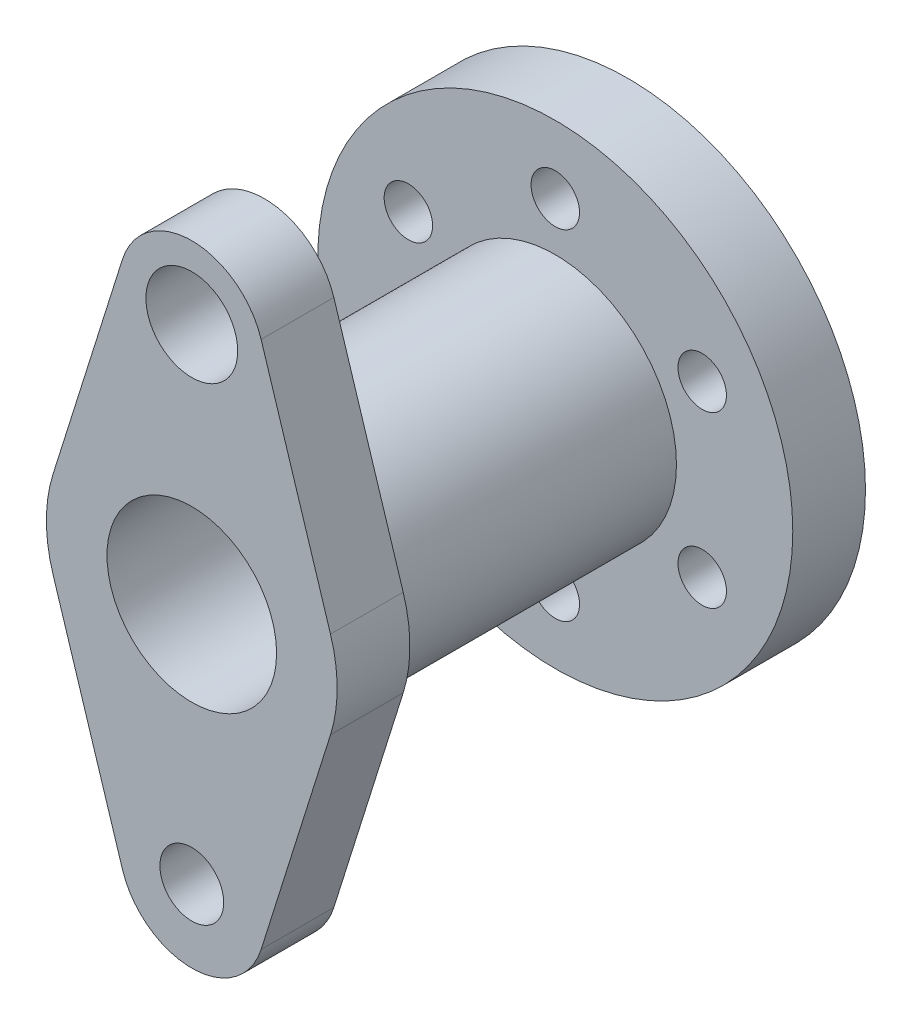
ISO-10303-21;
HEADER;
FILE_DESCRIPTION(('STEP AP214'),'2;1');
FILE_NAME('part.step','',(''),(''),'','','');
FILE_SCHEMA(('AUTOMOTIVE_DESIGN { 1 0 10303 214 1 1 1 1 }'));
ENDSEC;
DATA;
#1=APPLICATION_CONTEXT('core data for automotive mechanical design processes');
#2=APPLICATION_PROTOCOL_DEFINITION('international standard','automotive_design',2000,#1);
#3=PRODUCT_CONTEXT('',#1,'mechanical');
#4=PRODUCT('Part','Part','',(#3));
#5=PRODUCT_RELATED_PRODUCT_CATEGORY('part','',(#4));
#6=PRODUCT_DEFINITION_FORMATION('','',#4);
#7=PRODUCT_DEFINITION_CONTEXT('part definition',#1,'design');
#8=PRODUCT_DEFINITION('design','',#6,#7);
#9=PRODUCT_DEFINITION_SHAPE('','',#8);
#10=(LENGTH_UNIT() NAMED_UNIT(*) SI_UNIT(.MILLI.,.METRE.));
#11=(NAMED_UNIT(*) PLANE_ANGLE_UNIT() SI_UNIT($,.RADIAN.));
#12=(NAMED_UNIT(*) SI_UNIT($,.STERADIAN.) SOLID_ANGLE_UNIT());
#13=UNCERTAINTY_MEASURE_WITH_UNIT(LENGTH_MEASURE(1.E-05),#10,'distance_accuracy_value','');
#14=(GEOMETRIC_REPRESENTATION_CONTEXT(3) GLOBAL_UNCERTAINTY_ASSIGNED_CONTEXT((#13)) GLOBAL_UNIT_ASSIGNED_CONTEXT((#10,
#11,#12)) REPRESENTATION_CONTEXT('',''));
#15=CARTESIAN_POINT('',(0.,0.,0.));
#16=DIRECTION('',(0.,0.,1.));
#17=DIRECTION('',(1.,0.,0.));
#18=AXIS2_PLACEMENT_3D('',#15,#16,#17);
#19=CARTESIAN_POINT('',(0.,0.,45.));
#20=DIRECTION('',(0.,0.,1.));
#21=DIRECTION('',(1.,0.,0.));
#22=AXIS2_PLACEMENT_3D('',#19,#20,#21);
#23=PLANE('',#22);
#24=CARTESIAN_POINT('',(0.,0.,45.));
#25=DIRECTION('',(0.,0.,1.));
#26=DIRECTION('',(1.,0.,0.));
#27=AXIS2_PLACEMENT_3D('',#24,#25,#26);
#28=CIRCLE('',#27,13.);
#29=CARTESIAN_POINT('',(13.,0.,45.));
#30=VERTEX_POINT('',#29);
#31=EDGE_CURVE('E217',#30,#30,#28,.T.);
#32=ORIENTED_EDGE('',*,*,#31,.F.);
#33=EDGE_LOOP('',(#32));
#34=FACE_BOUND('',#33,.T.);
#35=CARTESIAN_POINT('',(0.,0.,45.));
#36=DIRECTION('',(0.,0.,1.));
#37=DIRECTION('',(1.,0.,0.));
#38=AXIS2_PLACEMENT_3D('',#35,#36,#37);
#39=CIRCLE('',#38,17.5);
#40=CARTESIAN_POINT('',(17.5,0.,45.));
#41=VERTEX_POINT('',#40);
#42=EDGE_CURVE('E208',#41,#41,#39,.T.);
#43=ORIENTED_EDGE('',*,*,#42,.T.);
#44=EDGE_LOOP('',(#43));
#45=FACE_BOUND('',#44,.T.);
#46=ADVANCED_FACE('F45',(#34,#45),#23,.T.);
#47=CARTESIAN_POINT('',(0.,0.,15.));
#48=DIRECTION('',(0.,0.,1.));
#49=DIRECTION('',(1.,0.,0.));
#50=AXIS2_PLACEMENT_3D('',#47,#48,#49);
#51=PLANE('',#50);
#52=CARTESIAN_POINT('',(2.44403693719019E-13,-35.,15.));
#53=DIRECTION('',(0.,0.,1.));
#54=DIRECTION('',(1.,0.,0.));
#55=AXIS2_PLACEMENT_3D('',#52,#53,#54);
#56=CIRCLE('',#55,5.);
#57=CARTESIAN_POINT('',(5.00000000000025,-35.,15.));
#58=VERTEX_POINT('',#57);
#59=EDGE_CURVE('E233',#58,#58,#56,.T.);
#60=ORIENTED_EDGE('',*,*,#59,.F.);
#61=EDGE_LOOP('',(#60));
#62=FACE_BOUND('',#61,.T.);
#63=CARTESIAN_POINT('',(30.3108891324552,17.5000000000004,15.));
#64=DIRECTION('',(0.,0.,1.));
#65=DIRECTION('',(1.,0.,0.));
#66=AXIS2_PLACEMENT_3D('',#63,#64,#65);
#67=CIRCLE('',#66,5.);
#68=CARTESIAN_POINT('',(35.3108891324552,17.5000000000004,15.));
#69=VERTEX_POINT('',#68);
#70=EDGE_CURVE('E249',#69,#69,#67,.T.);
#71=ORIENTED_EDGE('',*,*,#70,.F.);
#72=EDGE_LOOP('',(#71));
#73=FACE_BOUND('',#72,.T.);
#74=CARTESIAN_POINT('',(0.,35.,15.));
#75=DIRECTION('',(0.,0.,1.));
#76=DIRECTION('',(1.,0.,0.));
#77=AXIS2_PLACEMENT_3D('',#74,#75,#76);
#78=CIRCLE('',#77,5.);
#79=CARTESIAN_POINT('',(5.,35.,15.));
#80=VERTEX_POINT('',#79);
#81=EDGE_CURVE('E265',#80,#80,#78,.T.);
#82=ORIENTED_EDGE('',*,*,#81,.F.);
#83=EDGE_LOOP('',(#82));
#84=FACE_BOUND('',#83,.T.);
#85=CARTESIAN_POINT('',(0.,0.,15.));
#86=DIRECTION('',(0.,0.,1.));
#87=DIRECTION('',(1.,0.,0.));
#88=AXIS2_PLACEMENT_3D('',#85,#86,#87);
#89=CIRCLE('',#88,49.);
#90=CARTESIAN_POINT('',(49.,0.,15.));
#91=VERTEX_POINT('',#90);
#92=EDGE_CURVE('E11',#91,#91,#89,.T.);
#93=ORIENTED_EDGE('',*,*,#92,.T.);
#94=EDGE_LOOP('',(#93));
#95=FACE_BOUND('',#94,.T.);
#96=CARTESIAN_POINT('',(0.,0.,15.));
#97=DIRECTION('',(0.,0.,1.));
#98=DIRECTION('',(1.,0.,0.));
#99=AXIS2_PLACEMENT_3D('',#96,#97,#98);
#100=CIRCLE('',#99,25.);
#101=CARTESIAN_POINT('',(25.,0.,15.));
#102=VERTEX_POINT('',#101);
#103=EDGE_CURVE('E269',#102,#102,#100,.T.);
#104=ORIENTED_EDGE('',*,*,#103,.F.);
#105=EDGE_LOOP('',(#104));
#106=FACE_BOUND('',#105,.T.);
#107=CARTESIAN_POINT('',(-30.3108891324554,17.4999999999999,15.));
#108=DIRECTION('',(0.,0.,1.));
#109=DIRECTION('',(1.,0.,0.));
#110=AXIS2_PLACEMENT_3D('',#107,#108,#109);
#111=CIRCLE('',#110,5.);
#112=CARTESIAN_POINT('',(-25.3108891324554,17.4999999999999,15.));
#113=VERTEX_POINT('',#112);
#114=EDGE_CURVE('E257',#113,#113,#111,.T.);
#115=ORIENTED_EDGE('',*,*,#114,.F.);
#116=EDGE_LOOP('',(#115));
#117=FACE_BOUND('',#116,.T.);
#118=CARTESIAN_POINT('',(30.3108891324555,-17.4999999999997,15.));
#119=DIRECTION('',(0.,0.,1.));
#120=DIRECTION('',(1.,0.,0.));
#121=AXIS2_PLACEMENT_3D('',#118,#119,#120);
#122=CIRCLE('',#121,5.);
#123=CARTESIAN_POINT('',(35.3108891324555,-17.4999999999997,15.));
#124=VERTEX_POINT('',#123);
#125=EDGE_CURVE('E241',#124,#124,#122,.T.);
#126=ORIENTED_EDGE('',*,*,#125,.F.);
#127=EDGE_LOOP('',(#126));
#128=FACE_BOUND('',#127,.T.);
#129=CARTESIAN_POINT('',(-30.3108891324553,-17.5000000000001,15.));
#130=DIRECTION('',(0.,0.,1.));
#131=DIRECTION('',(1.,0.,0.));
#132=AXIS2_PLACEMENT_3D('',#129,#130,#131);
#133=CIRCLE('',#132,5.);
#134=CARTESIAN_POINT('',(-25.3108891324553,-17.5000000000001,15.));
#135=VERTEX_POINT('',#134);
#136=EDGE_CURVE('E225',#135,#135,#133,.T.);
#137=ORIENTED_EDGE('',*,*,#136,.F.);
#138=EDGE_LOOP('',(#137));
#139=FACE_BOUND('',#138,.T.);
#140=ADVANCED_FACE('F285',(#62,#73,#84,#95,#106,#117,#128,#139),#51,.T.);
#141=CARTESIAN_POINT('',(0.,0.,0.));
#142=DIRECTION('',(0.,0.,1.));
#143=DIRECTION('',(1.,0.,0.));
#144=AXIS2_PLACEMENT_3D('',#141,#142,#143);
#145=PLANE('',#144);
#146=CARTESIAN_POINT('',(0.,0.,0.));
#147=DIRECTION('',(0.,0.,1.));
#148=DIRECTION('',(1.,0.,0.));
#149=AXIS2_PLACEMENT_3D('',#146,#147,#148);
#150=CIRCLE('',#149,49.);
#151=CARTESIAN_POINT('',(49.,0.,0.));
#152=VERTEX_POINT('',#151);
#153=EDGE_CURVE('E49',#152,#152,#150,.T.);
#154=ORIENTED_EDGE('',*,*,#153,.F.);
#155=EDGE_LOOP('',(#154));
#156=FACE_BOUND('',#155,.T.);
#157=CARTESIAN_POINT('',(0.,35.,0.));
#158=DIRECTION('',(0.,0.,1.));
#159=DIRECTION('',(1.,0.,0.));
#160=AXIS2_PLACEMENT_3D('',#157,#158,#159);
#161=CIRCLE('',#160,5.);
#162=CARTESIAN_POINT('',(5.,35.,0.));
#163=VERTEX_POINT('',#162);
#164=EDGE_CURVE('E261',#163,#163,#161,.T.);
#165=ORIENTED_EDGE('',*,*,#164,.T.);
#166=EDGE_LOOP('',(#165));
#167=FACE_BOUND('',#166,.T.);
#168=CARTESIAN_POINT('',(-30.3108891324554,17.4999999999999,0.));
#169=DIRECTION('',(0.,0.,1.));
#170=DIRECTION('',(1.,0.,0.));
#171=AXIS2_PLACEMENT_3D('',#168,#169,#170);
#172=CIRCLE('',#171,5.);
#173=CARTESIAN_POINT('',(-25.3108891324554,17.4999999999999,0.));
#174=VERTEX_POINT('',#173);
#175=EDGE_CURVE('E253',#174,#174,#172,.T.);
#176=ORIENTED_EDGE('',*,*,#175,.T.);
#177=EDGE_LOOP('',(#176));
#178=FACE_BOUND('',#177,.T.);
#179=CARTESIAN_POINT('',(30.3108891324552,17.5000000000004,0.));
#180=DIRECTION('',(0.,0.,1.));
#181=DIRECTION('',(1.,0.,0.));
#182=AXIS2_PLACEMENT_3D('',#179,#180,#181);
#183=CIRCLE('',#182,5.);
#184=CARTESIAN_POINT('',(35.3108891324552,17.5000000000004,0.));
#185=VERTEX_POINT('',#184);
#186=EDGE_CURVE('E245',#185,#185,#183,.T.);
#187=ORIENTED_EDGE('',*,*,#186,.T.);
#188=EDGE_LOOP('',(#187));
#189=FACE_BOUND('',#188,.T.);
#190=CARTESIAN_POINT('',(30.3108891324555,-17.4999999999997,0.));
#191=DIRECTION('',(0.,0.,1.));
#192=DIRECTION('',(1.,0.,0.));
#193=AXIS2_PLACEMENT_3D('',#190,#191,#192);
#194=CIRCLE('',#193,5.);
#195=CARTESIAN_POINT('',(35.3108891324555,-17.4999999999997,0.));
#196=VERTEX_POINT('',#195);
#197=EDGE_CURVE('E237',#196,#196,#194,.T.);
#198=ORIENTED_EDGE('',*,*,#197,.T.);
#199=EDGE_LOOP('',(#198));
#200=FACE_BOUND('',#199,.T.);
#201=CARTESIAN_POINT('',(2.44403693719019E-13,-35.,0.));
#202=DIRECTION('',(0.,0.,1.));
#203=DIRECTION('',(1.,0.,0.));
#204=AXIS2_PLACEMENT_3D('',#201,#202,#203);
#205=CIRCLE('',#204,5.);
#206=CARTESIAN_POINT('',(5.00000000000025,-35.,0.));
#207=VERTEX_POINT('',#206);
#208=EDGE_CURVE('E229',#207,#207,#205,.T.);
#209=ORIENTED_EDGE('',*,*,#208,.T.);
#210=EDGE_LOOP('',(#209));
#211=FACE_BOUND('',#210,.T.);
#212=CARTESIAN_POINT('',(-30.3108891324553,-17.5000000000001,0.));
#213=DIRECTION('',(0.,0.,1.));
#214=DIRECTION('',(1.,0.,0.));
#215=AXIS2_PLACEMENT_3D('',#212,#213,#214);
#216=CIRCLE('',#215,5.);
#217=CARTESIAN_POINT('',(-25.3108891324553,-17.5000000000001,0.));
#218=VERTEX_POINT('',#217);
#219=EDGE_CURVE('E221',#218,#218,#216,.T.);
#220=ORIENTED_EDGE('',*,*,#219,.T.);
#221=EDGE_LOOP('',(#220));
#222=FACE_BOUND('',#221,.T.);
#223=CARTESIAN_POINT('',(0.,0.,0.));
#224=DIRECTION('',(0.,0.,1.));
#225=DIRECTION('',(1.,0.,0.));
#226=AXIS2_PLACEMENT_3D('',#223,#224,#225);
#227=CIRCLE('',#226,13.);
#228=CARTESIAN_POINT('',(13.,0.,0.));
#229=VERTEX_POINT('',#228);
#230=EDGE_CURVE('E216',#229,#229,#227,.T.);
#231=ORIENTED_EDGE('',*,*,#230,.T.);
#232=EDGE_LOOP('',(#231));
#233=FACE_BOUND('',#232,.T.);
#234=ADVANCED_FACE('F282',(#156,#167,#178,#189,#200,#211,#222,#233),#145,.F.);
#235=CARTESIAN_POINT('',(0.,0.,15.));
#236=DIRECTION('',(0.,0.,-1.));
#237=DIRECTION('',(-1.,0.,0.));
#238=AXIS2_PLACEMENT_3D('',#235,#236,#237);
#239=CYLINDRICAL_SURFACE('',#238,49.);
#240=ORIENTED_EDGE('',*,*,#92,.F.);
#241=EDGE_LOOP('',(#240));
#242=FACE_BOUND('',#241,.T.);
#243=ORIENTED_EDGE('',*,*,#153,.T.);
#244=EDGE_LOOP('',(#243));
#245=FACE_BOUND('',#244,.T.);
#246=ADVANCED_FACE('F47',(#242,#245),#239,.T.);
#247=CARTESIAN_POINT('',(0.,35.,15.));
#248=DIRECTION('',(0.,0.,-1.));
#249=DIRECTION('',(-1.,0.,0.));
#250=AXIS2_PLACEMENT_3D('',#247,#248,#249);
#251=CYLINDRICAL_SURFACE('',#250,5.);
#252=ORIENTED_EDGE('',*,*,#81,.T.);
#253=EDGE_LOOP('',(#252));
#254=FACE_BOUND('',#253,.T.);
#255=ORIENTED_EDGE('',*,*,#164,.F.);
#256=EDGE_LOOP('',(#255));
#257=FACE_BOUND('',#256,.T.);
#258=ADVANCED_FACE('F344',(#254,#257),#251,.F.);
#259=CARTESIAN_POINT('',(-30.3108891324554,17.4999999999999,15.));
#260=DIRECTION('',(0.,0.,-1.));
#261=DIRECTION('',(-1.,0.,0.));
#262=AXIS2_PLACEMENT_3D('',#259,#260,#261);
#263=CYLINDRICAL_SURFACE('',#262,5.);
#264=ORIENTED_EDGE('',*,*,#114,.T.);
#265=EDGE_LOOP('',(#264));
#266=FACE_BOUND('',#265,.T.);
#267=ORIENTED_EDGE('',*,*,#175,.F.);
#268=EDGE_LOOP('',(#267));
#269=FACE_BOUND('',#268,.T.);
#270=ADVANCED_FACE('F340',(#266,#269),#263,.F.);
#271=CARTESIAN_POINT('',(30.3108891324552,17.5000000000004,15.));
#272=DIRECTION('',(0.,0.,-1.));
#273=DIRECTION('',(-1.,0.,0.));
#274=AXIS2_PLACEMENT_3D('',#271,#272,#273);
#275=CYLINDRICAL_SURFACE('',#274,5.);
#276=ORIENTED_EDGE('',*,*,#70,.T.);
#277=EDGE_LOOP('',(#276));
#278=FACE_BOUND('',#277,.T.);
#279=ORIENTED_EDGE('',*,*,#186,.F.);
#280=EDGE_LOOP('',(#279));
#281=FACE_BOUND('',#280,.T.);
#282=ADVANCED_FACE('F336',(#278,#281),#275,.F.);
#283=CARTESIAN_POINT('',(30.3108891324555,-17.4999999999997,15.));
#284=DIRECTION('',(0.,0.,-1.));
#285=DIRECTION('',(-1.,0.,0.));
#286=AXIS2_PLACEMENT_3D('',#283,#284,#285);
#287=CYLINDRICAL_SURFACE('',#286,5.);
#288=ORIENTED_EDGE('',*,*,#125,.T.);
#289=EDGE_LOOP('',(#288));
#290=FACE_BOUND('',#289,.T.);
#291=ORIENTED_EDGE('',*,*,#197,.F.);
#292=EDGE_LOOP('',(#291));
#293=FACE_BOUND('',#292,.T.);
#294=ADVANCED_FACE('F332',(#290,#293),#287,.F.);
#295=CARTESIAN_POINT('',(2.44403693719019E-13,-35.,15.));
#296=DIRECTION('',(0.,0.,-1.));
#297=DIRECTION('',(-1.,0.,0.));
#298=AXIS2_PLACEMENT_3D('',#295,#296,#297);
#299=CYLINDRICAL_SURFACE('',#298,5.);
#300=ORIENTED_EDGE('',*,*,#59,.T.);
#301=EDGE_LOOP('',(#300));
#302=FACE_BOUND('',#301,.T.);
#303=ORIENTED_EDGE('',*,*,#208,.F.);
#304=EDGE_LOOP('',(#303));
#305=FACE_BOUND('',#304,.T.);
#306=ADVANCED_FACE('F328',(#302,#305),#299,.F.);
#307=CARTESIAN_POINT('',(-30.3108891324553,-17.5000000000001,15.));
#308=DIRECTION('',(0.,0.,-1.));
#309=DIRECTION('',(-1.,0.,0.));
#310=AXIS2_PLACEMENT_3D('',#307,#308,#309);
#311=CYLINDRICAL_SURFACE('',#310,5.);
#312=ORIENTED_EDGE('',*,*,#136,.T.);
#313=EDGE_LOOP('',(#312));
#314=FACE_BOUND('',#313,.T.);
#315=ORIENTED_EDGE('',*,*,#219,.F.);
#316=EDGE_LOOP('',(#315));
#317=FACE_BOUND('',#316,.T.);
#318=ADVANCED_FACE('F313',(#314,#317),#311,.F.);
#319=CARTESIAN_POINT('',(0.,0.,45.));
#320=DIRECTION('',(0.,0.,-1.));
#321=DIRECTION('',(-1.,0.,0.));
#322=AXIS2_PLACEMENT_3D('',#319,#320,#321);
#323=CYLINDRICAL_SURFACE('',#322,25.);
#324=ORIENTED_EDGE('',*,*,#103,.T.);
#325=EDGE_LOOP('',(#324));
#326=FACE_BOUND('',#325,.T.);
#327=CARTESIAN_POINT('',(0.,0.,75.));
#328=DIRECTION('',(0.,0.,1.));
#329=DIRECTION('',(1.,0.,0.));
#330=AXIS2_PLACEMENT_3D('',#327,#328,#329);
#331=CIRCLE('',#330,25.);
#332=CARTESIAN_POINT('',(25.,0.,75.));
#333=VERTEX_POINT('',#332);
#334=EDGE_CURVE('E212',#333,#333,#331,.T.);
#335=ORIENTED_EDGE('',*,*,#334,.F.);
#336=EDGE_LOOP('',(#335));
#337=FACE_BOUND('',#336,.T.);
#338=ADVANCED_FACE('F303',(#326,#337),#323,.T.);
#339=CARTESIAN_POINT('',(0.,0.,45.));
#340=DIRECTION('',(0.,0.,-1.));
#341=DIRECTION('',(-1.,0.,0.));
#342=AXIS2_PLACEMENT_3D('',#339,#340,#341);
#343=CYLINDRICAL_SURFACE('',#342,13.);
#344=ORIENTED_EDGE('',*,*,#31,.T.);
#345=EDGE_LOOP('',(#344));
#346=FACE_BOUND('',#345,.T.);
#347=ORIENTED_EDGE('',*,*,#230,.F.);
#348=EDGE_LOOP('',(#347));
#349=FACE_BOUND('',#348,.T.);
#350=ADVANCED_FACE('F300',(#346,#349),#343,.F.);
#351=CARTESIAN_POINT('',(0.,0.,75.));
#352=DIRECTION('',(0.,0.,-1.));
#353=DIRECTION('',(-1.,0.,0.));
#354=AXIS2_PLACEMENT_3D('',#351,#352,#353);
#355=CYLINDRICAL_SURFACE('',#354,17.5);
#356=ORIENTED_EDGE('',*,*,#42,.F.);
#357=EDGE_LOOP('',(#356));
#358=FACE_BOUND('',#357,.T.);
#359=CARTESIAN_POINT('',(0.,0.,90.));
#360=DIRECTION('',(0.,0.,1.));
#361=DIRECTION('',(1.,0.,0.));
#362=AXIS2_PLACEMENT_3D('',#359,#360,#361);
#363=CIRCLE('',#362,17.5);
#364=CARTESIAN_POINT('',(17.5,0.,90.));
#365=VERTEX_POINT('',#364);
#366=EDGE_CURVE('E161',#365,#365,#363,.T.);
#367=ORIENTED_EDGE('',*,*,#366,.T.);
#368=EDGE_LOOP('',(#367));
#369=FACE_BOUND('',#368,.T.);
#370=ADVANCED_FACE('F302',(#358,#369),#355,.F.);
#371=CARTESIAN_POINT('',(28.6181760425084,-8.99999999999998,90.));
#372=DIRECTION('',(0.953939201416946,-0.299999999999999,0.));
#373=DIRECTION('',(0.299999999999999,0.953939201416946,0.));
#374=AXIS2_PLACEMENT_3D('',#371,#372,#373);
#375=PLANE('',#374);
#376=DIRECTION('',(-0.299999999999999,-0.953939201416946,0.));
#377=VECTOR('',#376,1.);
#378=CARTESIAN_POINT('',(28.6181760425084,-8.99999999999998,75.));
#379=LINE('',#378,#377);
#380=CARTESIAN_POINT('',(28.6181760425084,-8.99999999999998,75.));
#381=VERTEX_POINT('',#380);
#382=CARTESIAN_POINT('',(14.3090880212542,-54.5,75.));
#383=VERTEX_POINT('',#382);
#384=EDGE_CURVE('E156',#381,#383,#379,.T.);
#385=ORIENTED_EDGE('',*,*,#384,.F.);
#386=DIRECTION('',(0.,0.,-1.));
#387=VECTOR('',#386,1.);
#388=CARTESIAN_POINT('',(28.6181760425084,-8.99999999999998,90.));
#389=LINE('',#388,#387);
#390=CARTESIAN_POINT('',(28.6181760425084,-8.99999999999998,90.));
#391=VERTEX_POINT('',#390);
#392=EDGE_CURVE('E104',#391,#381,#389,.T.);
#393=ORIENTED_EDGE('',*,*,#392,.F.);
#394=DIRECTION('',(-0.299999999999999,-0.953939201416946,0.));
#395=VECTOR('',#394,1.);
#396=CARTESIAN_POINT('',(28.6181760425084,-8.99999999999998,90.));
#397=LINE('',#396,#395);
#398=CARTESIAN_POINT('',(14.3090880212542,-54.5,90.));
#399=VERTEX_POINT('',#398);
#400=EDGE_CURVE('E188',#391,#399,#397,.T.);
#401=ORIENTED_EDGE('',*,*,#400,.T.);
#402=DIRECTION('',(0.,0.,-1.));
#403=VECTOR('',#402,1.);
#404=CARTESIAN_POINT('',(14.3090880212542,-54.5,90.));
#405=LINE('',#404,#403);
#406=EDGE_CURVE('E99',#399,#383,#405,.T.);
#407=ORIENTED_EDGE('',*,*,#406,.T.);
#408=EDGE_LOOP('',(#385,#393,#401,#407));
#409=FACE_BOUND('',#408,.T.);
#410=ADVANCED_FACE('F310',(#409),#375,.T.);
#411=CARTESIAN_POINT('',(0.,0.,90.));
#412=DIRECTION('',(0.,0.,-1.));
#413=DIRECTION('',(-1.,0.,0.));
#414=AXIS2_PLACEMENT_3D('',#411,#412,#413);
#415=CYLINDRICAL_SURFACE('',#414,30.);
#416=CARTESIAN_POINT('',(0.,0.,75.));
#417=DIRECTION('',(0.,0.,1.));
#418=DIRECTION('',(1.,0.,0.));
#419=AXIS2_PLACEMENT_3D('',#416,#417,#418);
#420=CIRCLE('',#419,30.);
#421=CARTESIAN_POINT('',(28.6181760425084,8.99999999999998,75.));
#422=VERTEX_POINT('',#421);
#423=EDGE_CURVE('E160',#381,#422,#420,.T.);
#424=ORIENTED_EDGE('',*,*,#423,.T.);
#425=DIRECTION('',(0.,0.,-1.));
#426=VECTOR('',#425,1.);
#427=CARTESIAN_POINT('',(28.6181760425084,8.99999999999998,90.));
#428=LINE('',#427,#426);
#429=CARTESIAN_POINT('',(28.6181760425084,8.99999999999998,90.));
#430=VERTEX_POINT('',#429);
#431=EDGE_CURVE('E202',#430,#422,#428,.T.);
#432=ORIENTED_EDGE('',*,*,#431,.F.);
#433=CARTESIAN_POINT('',(0.,0.,90.));
#434=DIRECTION('',(0.,0.,1.));
#435=DIRECTION('',(1.,0.,0.));
#436=AXIS2_PLACEMENT_3D('',#433,#434,#435);
#437=CIRCLE('',#436,30.);
#438=EDGE_CURVE('E131',#391,#430,#437,.T.);
#439=ORIENTED_EDGE('',*,*,#438,.F.);
#440=ORIENTED_EDGE('',*,*,#392,.T.);
#441=EDGE_LOOP('',(#424,#432,#439,#440));
#442=FACE_BOUND('',#441,.T.);
#443=ADVANCED_FACE('F454',(#442),#415,.T.);
#444=CARTESIAN_POINT('',(28.6181760425084,8.99999999999998,90.));
#445=DIRECTION('',(-0.953939201416946,-0.299999999999999,0.));
#446=DIRECTION('',(0.299999999999999,-0.953939201416946,0.));
#447=AXIS2_PLACEMENT_3D('',#444,#445,#446);
#448=PLANE('',#447);
#449=DIRECTION('',(-0.299999999999999,0.953939201416946,0.));
#450=VECTOR('',#449,1.);
#451=CARTESIAN_POINT('',(28.6181760425084,8.99999999999998,75.));
#452=LINE('',#451,#450);
#453=CARTESIAN_POINT('',(14.3090880212542,54.5,75.));
#454=VERTEX_POINT('',#453);
#455=EDGE_CURVE('E164',#422,#454,#452,.T.);
#456=ORIENTED_EDGE('',*,*,#455,.T.);
#457=DIRECTION('',(0.,0.,-1.));
#458=VECTOR('',#457,1.);
#459=CARTESIAN_POINT('',(14.3090880212542,54.5,90.));
#460=LINE('',#459,#458);
#461=CARTESIAN_POINT('',(14.3090880212542,54.5,90.));
#462=VERTEX_POINT('',#461);
#463=EDGE_CURVE('E198',#462,#454,#460,.T.);
#464=ORIENTED_EDGE('',*,*,#463,.F.);
#465=DIRECTION('',(-0.299999999999999,0.953939201416946,0.));
#466=VECTOR('',#465,1.);
#467=CARTESIAN_POINT('',(28.6181760425084,8.99999999999998,90.));
#468=LINE('',#467,#466);
#469=EDGE_CURVE('E628',#430,#462,#468,.T.);
#470=ORIENTED_EDGE('',*,*,#469,.F.);
#471=ORIENTED_EDGE('',*,*,#431,.T.);
#472=EDGE_LOOP('',(#456,#464,#470,#471));
#473=FACE_BOUND('',#472,.T.);
#474=ADVANCED_FACE('F464',(#473),#448,.F.);
#475=CARTESIAN_POINT('',(0.,50.,90.));
#476=DIRECTION('',(0.,0.,-1.));
#477=DIRECTION('',(-1.,0.,0.));
#478=AXIS2_PLACEMENT_3D('',#475,#476,#477);
#479=CYLINDRICAL_SURFACE('',#478,15.);
#480=CARTESIAN_POINT('',(0.,50.,75.));
#481=DIRECTION('',(0.,0.,1.));
#482=DIRECTION('',(1.,0.,0.));
#483=AXIS2_PLACEMENT_3D('',#480,#481,#482);
#484=CIRCLE('',#483,15.);
#485=CARTESIAN_POINT('',(-14.3090880212542,54.4999999999999,75.));
#486=VERTEX_POINT('',#485);
#487=EDGE_CURVE('E167',#454,#486,#484,.T.);
#488=ORIENTED_EDGE('',*,*,#487,.T.);
#489=DIRECTION('',(0.,0.,-1.));
#490=VECTOR('',#489,1.);
#491=CARTESIAN_POINT('',(-14.3090880212542,54.4999999999999,90.));
#492=LINE('',#491,#490);
#493=CARTESIAN_POINT('',(-14.3090880212542,54.4999999999999,90.));
#494=VERTEX_POINT('',#493);
#495=EDGE_CURVE('E195',#494,#486,#492,.T.);
#496=ORIENTED_EDGE('',*,*,#495,.F.);
#497=CARTESIAN_POINT('',(0.,50.,90.));
#498=DIRECTION('',(0.,0.,1.));
#499=DIRECTION('',(1.,0.,0.));
#500=AXIS2_PLACEMENT_3D('',#497,#498,#499);
#501=CIRCLE('',#500,15.);
#502=EDGE_CURVE('E630',#462,#494,#501,.T.);
#503=ORIENTED_EDGE('',*,*,#502,.F.);
#504=ORIENTED_EDGE('',*,*,#463,.T.);
#505=EDGE_LOOP('',(#488,#496,#503,#504));
#506=FACE_BOUND('',#505,.T.);
#507=ADVANCED_FACE('F475',(#506),#479,.T.);
#508=CARTESIAN_POINT('',(-28.6181760425084,9.,90.));
#509=DIRECTION('',(-0.953939201416946,0.3,0.));
#510=DIRECTION('',(-0.3,-0.953939201416946,0.));
#511=AXIS2_PLACEMENT_3D('',#508,#509,#510);
#512=PLANE('',#511);
#513=DIRECTION('',(0.3,0.953939201416946,0.));
#514=VECTOR('',#513,1.);
#515=CARTESIAN_POINT('',(-28.6181760425084,9.,75.));
#516=LINE('',#515,#514);
#517=CARTESIAN_POINT('',(-28.6181760425084,9.00000000000001,75.));
#518=VERTEX_POINT('',#517);
#519=EDGE_CURVE('E171',#518,#486,#516,.T.);
#520=ORIENTED_EDGE('',*,*,#519,.F.);
#521=DIRECTION('',(0.,0.,-1.));
#522=VECTOR('',#521,1.);
#523=CARTESIAN_POINT('',(-28.6181760425084,9.00000000000001,90.));
#524=LINE('',#523,#522);
#525=CARTESIAN_POINT('',(-28.6181760425084,9.00000000000001,90.));
#526=VERTEX_POINT('',#525);
#527=EDGE_CURVE('E137',#526,#518,#524,.T.);
#528=ORIENTED_EDGE('',*,*,#527,.F.);
#529=DIRECTION('',(0.3,0.953939201416946,0.));
#530=VECTOR('',#529,1.);
#531=CARTESIAN_POINT('',(-28.6181760425084,9.,90.));
#532=LINE('',#531,#530);
#533=EDGE_CURVE('E127',#526,#494,#532,.T.);
#534=ORIENTED_EDGE('',*,*,#533,.T.);
#535=ORIENTED_EDGE('',*,*,#495,.T.);
#536=EDGE_LOOP('',(#520,#528,#534,#535));
#537=FACE_BOUND('',#536,.T.);
#538=ADVANCED_FACE('F486',(#537),#512,.T.);
#539=CARTESIAN_POINT('',(-28.6181760425084,-9.00000000000001,75.));
#540=VERTEX_POINT('',#539);
#541=EDGE_CURVE('E135',#518,#540,#420,.T.);
#542=ORIENTED_EDGE('',*,*,#541,.T.);
#543=DIRECTION('',(0.,0.,-1.));
#544=VECTOR('',#543,1.);
#545=CARTESIAN_POINT('',(-28.6181760425084,-9.00000000000001,90.));
#546=LINE('',#545,#544);
#547=CARTESIAN_POINT('',(-28.6181760425084,-9.00000000000001,90.));
#548=VERTEX_POINT('',#547);
#549=EDGE_CURVE('E132',#548,#540,#546,.T.);
#550=ORIENTED_EDGE('',*,*,#549,.F.);
#551=EDGE_CURVE('E120',#526,#548,#437,.T.);
#552=ORIENTED_EDGE('',*,*,#551,.F.);
#553=ORIENTED_EDGE('',*,*,#527,.T.);
#554=EDGE_LOOP('',(#542,#550,#552,#553));
#555=FACE_BOUND('',#554,.T.);
#556=ADVANCED_FACE('F133',(#555),#415,.T.);
#557=CARTESIAN_POINT('',(-28.6181760425084,-9.,90.));
#558=DIRECTION('',(0.953939201416946,0.3,0.));
#559=DIRECTION('',(-0.3,0.953939201416946,0.));
#560=AXIS2_PLACEMENT_3D('',#557,#558,#559);
#561=PLANE('',#560);
#562=DIRECTION('',(0.3,-0.953939201416946,0.));
#563=VECTOR('',#562,1.);
#564=CARTESIAN_POINT('',(-28.6181760425084,-9.,75.));
#565=LINE('',#564,#563);
#566=CARTESIAN_POINT('',(-14.3090880212542,-54.4999999999999,75.));
#567=VERTEX_POINT('',#566);
#568=EDGE_CURVE('E92',#540,#567,#565,.T.);
#569=ORIENTED_EDGE('',*,*,#568,.T.);
#570=DIRECTION('',(0.,0.,-1.));
#571=VECTOR('',#570,1.);
#572=CARTESIAN_POINT('',(-14.3090880212542,-54.4999999999999,90.));
#573=LINE('',#572,#571);
#574=CARTESIAN_POINT('',(-14.3090880212542,-54.4999999999999,90.));
#575=VERTEX_POINT('',#574);
#576=EDGE_CURVE('E138',#575,#567,#573,.T.);
#577=ORIENTED_EDGE('',*,*,#576,.F.);
#578=DIRECTION('',(0.3,-0.953939201416946,0.));
#579=VECTOR('',#578,1.);
#580=CARTESIAN_POINT('',(-28.6181760425084,-9.,90.));
#581=LINE('',#580,#579);
#582=EDGE_CURVE('E125',#548,#575,#581,.T.);
#583=ORIENTED_EDGE('',*,*,#582,.F.);
#584=ORIENTED_EDGE('',*,*,#549,.T.);
#585=EDGE_LOOP('',(#569,#577,#583,#584));
#586=FACE_BOUND('',#585,.T.);
#587=ADVANCED_FACE('F140',(#586),#561,.F.);
#588=CARTESIAN_POINT('',(0.,-50.,90.));
#589=DIRECTION('',(0.,0.,-1.));
#590=DIRECTION('',(-1.,0.,0.));
#591=AXIS2_PLACEMENT_3D('',#588,#589,#590);
#592=CYLINDRICAL_SURFACE('',#591,6.5829747291931);
#593=CARTESIAN_POINT('',(0.,-50.,90.));
#594=DIRECTION('',(0.,0.,1.));
#595=DIRECTION('',(1.,0.,0.));
#596=AXIS2_PLACEMENT_3D('',#593,#594,#595);
#597=CIRCLE('',#596,6.5829747291931);
#598=CARTESIAN_POINT('',(6.58297472919311,-50.,90.));
#599=VERTEX_POINT('',#598);
#600=EDGE_CURVE('E144',#599,#599,#597,.T.);
#601=ORIENTED_EDGE('',*,*,#600,.T.);
#602=EDGE_LOOP('',(#601));
#603=FACE_BOUND('',#602,.T.);
#604=CARTESIAN_POINT('',(0.,-50.,75.));
#605=DIRECTION('',(0.,0.,1.));
#606=DIRECTION('',(1.,0.,0.));
#607=AXIS2_PLACEMENT_3D('',#604,#605,#606);
#608=CIRCLE('',#607,6.5829747291931);
#609=CARTESIAN_POINT('',(6.58297472919311,-50.,75.));
#610=VERTEX_POINT('',#609);
#611=EDGE_CURVE('E180',#610,#610,#608,.T.);
#612=ORIENTED_EDGE('',*,*,#611,.F.);
#613=EDGE_LOOP('',(#612));
#614=FACE_BOUND('',#613,.T.);
#615=ADVANCED_FACE('F515',(#603,#614),#592,.F.);
#616=CARTESIAN_POINT('',(0.,-50.,90.));
#617=DIRECTION('',(0.,0.,-1.));
#618=DIRECTION('',(-1.,0.,0.));
#619=AXIS2_PLACEMENT_3D('',#616,#617,#618);
#620=CYLINDRICAL_SURFACE('',#619,15.);
#621=CARTESIAN_POINT('',(0.,-50.,75.));
#622=DIRECTION('',(0.,0.,1.));
#623=DIRECTION('',(1.,0.,0.));
#624=AXIS2_PLACEMENT_3D('',#621,#622,#623);
#625=CIRCLE('',#624,15.);
#626=EDGE_CURVE('E177',#567,#383,#625,.T.);
#627=ORIENTED_EDGE('',*,*,#626,.T.);
#628=ORIENTED_EDGE('',*,*,#406,.F.);
#629=CARTESIAN_POINT('',(0.,-50.,90.));
#630=DIRECTION('',(0.,0.,1.));
#631=DIRECTION('',(1.,0.,0.));
#632=AXIS2_PLACEMENT_3D('',#629,#630,#631);
#633=CIRCLE('',#632,15.);
#634=EDGE_CURVE('E63',#575,#399,#633,.T.);
#635=ORIENTED_EDGE('',*,*,#634,.F.);
#636=ORIENTED_EDGE('',*,*,#576,.T.);
#637=EDGE_LOOP('',(#627,#628,#635,#636));
#638=FACE_BOUND('',#637,.T.);
#639=ADVANCED_FACE('F525',(#638),#620,.T.);
#640=CARTESIAN_POINT('',(0.,50.,90.));
#641=DIRECTION('',(0.,0.,-1.));
#642=DIRECTION('',(-1.,0.,0.));
#643=AXIS2_PLACEMENT_3D('',#640,#641,#642);
#644=CYLINDRICAL_SURFACE('',#643,9.46577149601455);
#645=CARTESIAN_POINT('',(0.,50.,90.));
#646=DIRECTION('',(0.,0.,1.));
#647=DIRECTION('',(1.,0.,0.));
#648=AXIS2_PLACEMENT_3D('',#645,#646,#647);
#649=CIRCLE('',#648,9.46577149601455);
#650=CARTESIAN_POINT('',(9.46577149601454,50.,90.));
#651=VERTEX_POINT('',#650);
#652=EDGE_CURVE('E152',#651,#651,#649,.T.);
#653=ORIENTED_EDGE('',*,*,#652,.T.);
#654=EDGE_LOOP('',(#653));
#655=FACE_BOUND('',#654,.T.);
#656=CARTESIAN_POINT('',(0.,50.,75.));
#657=DIRECTION('',(0.,0.,1.));
#658=DIRECTION('',(1.,0.,0.));
#659=AXIS2_PLACEMENT_3D('',#656,#657,#658);
#660=CIRCLE('',#659,9.46577149601455);
#661=CARTESIAN_POINT('',(9.46577149601454,50.,75.));
#662=VERTEX_POINT('',#661);
#663=EDGE_CURVE('E184',#662,#662,#660,.T.);
#664=ORIENTED_EDGE('',*,*,#663,.F.);
#665=EDGE_LOOP('',(#664));
#666=FACE_BOUND('',#665,.T.);
#667=ADVANCED_FACE('F536',(#655,#666),#644,.F.);
#668=CARTESIAN_POINT('',(0.,0.,90.));
#669=DIRECTION('',(0.,0.,1.));
#670=DIRECTION('',(1.,0.,0.));
#671=AXIS2_PLACEMENT_3D('',#668,#669,#670);
#672=PLANE('',#671);
#673=ORIENTED_EDGE('',*,*,#366,.F.);
#674=EDGE_LOOP('',(#673));
#675=FACE_BOUND('',#674,.T.);
#676=ORIENTED_EDGE('',*,*,#400,.F.);
#677=ORIENTED_EDGE('',*,*,#438,.T.);
#678=ORIENTED_EDGE('',*,*,#469,.T.);
#679=ORIENTED_EDGE('',*,*,#502,.T.);
#680=ORIENTED_EDGE('',*,*,#533,.F.);
#681=ORIENTED_EDGE('',*,*,#551,.T.);
#682=ORIENTED_EDGE('',*,*,#582,.T.);
#683=ORIENTED_EDGE('',*,*,#634,.T.);
#684=EDGE_LOOP('',(#676,#677,#678,#679,#680,#681,#682,#683));
#685=FACE_BOUND('',#684,.T.);
#686=ORIENTED_EDGE('',*,*,#600,.F.);
#687=EDGE_LOOP('',(#686));
#688=FACE_BOUND('',#687,.T.);
#689=ORIENTED_EDGE('',*,*,#652,.F.);
#690=EDGE_LOOP('',(#689));
#691=FACE_BOUND('',#690,.T.);
#692=ADVANCED_FACE('F122',(#675,#685,#688,#691),#672,.T.);
#693=CARTESIAN_POINT('',(0.,0.,75.));
#694=DIRECTION('',(0.,0.,1.));
#695=DIRECTION('',(1.,0.,0.));
#696=AXIS2_PLACEMENT_3D('',#693,#694,#695);
#697=PLANE('',#696);
#698=ORIENTED_EDGE('',*,*,#334,.T.);
#699=EDGE_LOOP('',(#698));
#700=FACE_BOUND('',#699,.T.);
#701=ORIENTED_EDGE('',*,*,#384,.T.);
#702=ORIENTED_EDGE('',*,*,#626,.F.);
#703=ORIENTED_EDGE('',*,*,#568,.F.);
#704=ORIENTED_EDGE('',*,*,#541,.F.);
#705=ORIENTED_EDGE('',*,*,#519,.T.);
#706=ORIENTED_EDGE('',*,*,#487,.F.);
#707=ORIENTED_EDGE('',*,*,#455,.F.);
#708=ORIENTED_EDGE('',*,*,#423,.F.);
#709=EDGE_LOOP('',(#701,#702,#703,#704,#705,#706,#707,#708));
#710=FACE_BOUND('',#709,.T.);
#711=ORIENTED_EDGE('',*,*,#611,.T.);
#712=EDGE_LOOP('',(#711));
#713=FACE_BOUND('',#712,.T.);
#714=ORIENTED_EDGE('',*,*,#663,.T.);
#715=EDGE_LOOP('',(#714));
#716=FACE_BOUND('',#715,.T.);
#717=ADVANCED_FACE('F555',(#700,#710,#713,#716),#697,.F.);
#718=CLOSED_SHELL('',(#46,#140,#234,#246,#258,#270,#282,#294,#306,#318,#338,#350,#370,#410,#443,
#474,#507,#538,#556,#587,#615,#639,#667,#692,#717));
#719=MANIFOLD_SOLID_BREP('B2',#718);
#720=ADVANCED_BREP_SHAPE_REPRESENTATION('',(#18,#719),#14);
#721=SHAPE_DEFINITION_REPRESENTATION(#9,#720);
ENDSEC;
END-ISO-10303-21;
